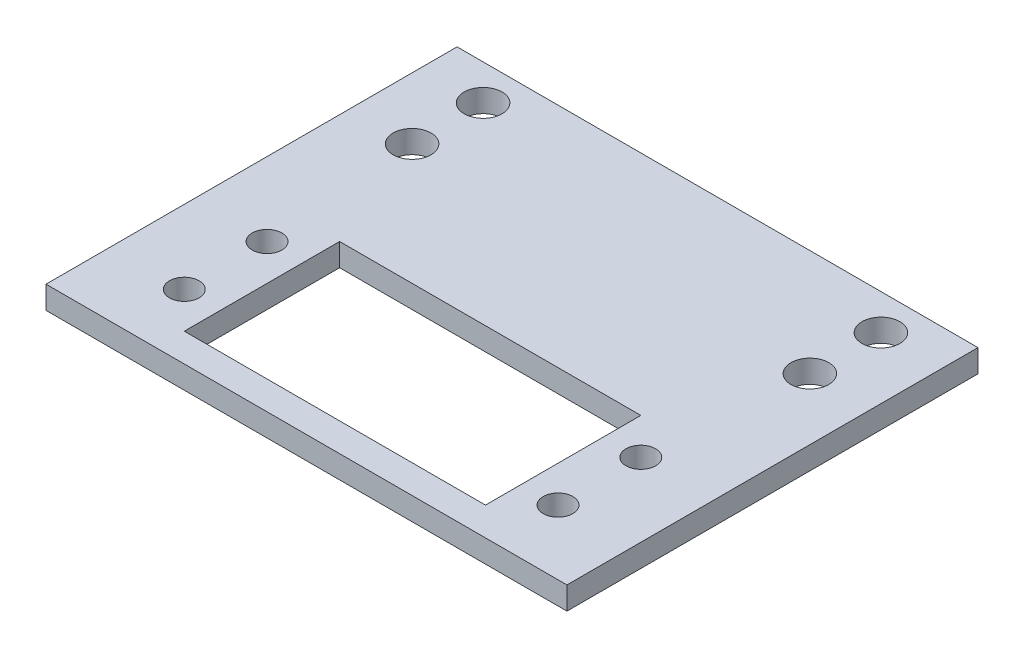
ISO-10303-21;
HEADER;
FILE_DESCRIPTION(('STEP AP214'),'2;1');
FILE_NAME('part.step','',(''),(''),'','','');
FILE_SCHEMA(('AUTOMOTIVE_DESIGN { 1 0 10303 214 1 1 1 1 }'));
ENDSEC;
DATA;
#1=APPLICATION_CONTEXT('core data for automotive mechanical design processes');
#2=APPLICATION_PROTOCOL_DEFINITION('international standard','automotive_design',2000,#1);
#3=PRODUCT_CONTEXT('',#1,'mechanical');
#4=PRODUCT('Part','Part','',(#3));
#5=PRODUCT_RELATED_PRODUCT_CATEGORY('part','',(#4));
#6=PRODUCT_DEFINITION_FORMATION('','',#4);
#7=PRODUCT_DEFINITION_CONTEXT('part definition',#1,'design');
#8=PRODUCT_DEFINITION('design','',#6,#7);
#9=PRODUCT_DEFINITION_SHAPE('','',#8);
#10=(LENGTH_UNIT() NAMED_UNIT(*) SI_UNIT(.MILLI.,.METRE.));
#11=(NAMED_UNIT(*) PLANE_ANGLE_UNIT() SI_UNIT($,.RADIAN.));
#12=(NAMED_UNIT(*) SI_UNIT($,.STERADIAN.) SOLID_ANGLE_UNIT());
#13=UNCERTAINTY_MEASURE_WITH_UNIT(LENGTH_MEASURE(1.E-05),#10,'distance_accuracy_value','');
#14=(GEOMETRIC_REPRESENTATION_CONTEXT(3) GLOBAL_UNCERTAINTY_ASSIGNED_CONTEXT((#13)) GLOBAL_UNIT_ASSIGNED_CONTEXT((#10,
#11,#12)) REPRESENTATION_CONTEXT('',''));
#15=CARTESIAN_POINT('',(0.,0.,0.));
#16=DIRECTION('',(0.,0.,1.));
#17=DIRECTION('',(1.,0.,0.));
#18=AXIS2_PLACEMENT_3D('',#15,#16,#17);
#19=CARTESIAN_POINT('',(0.,3.048,0.));
#20=DIRECTION('',(0.,1.,0.));
#21=DIRECTION('',(0.,0.,1.));
#22=AXIS2_PLACEMENT_3D('',#19,#20,#21);
#23=PLANE('',#22);
#24=CARTESIAN_POINT('',(26.67,3.048,-26.6065));
#25=DIRECTION('',(0.,1.,0.));
#26=DIRECTION('',(0.,0.,-1.));
#27=AXIS2_PLACEMENT_3D('',#24,#25,#26);
#28=CIRCLE('',#27,2.54);
#29=CARTESIAN_POINT('',(26.67,3.048,-29.1465));
#30=VERTEX_POINT('',#29);
#31=EDGE_CURVE('E264',#30,#30,#28,.T.);
#32=ORIENTED_EDGE('',*,*,#31,.F.);
#33=EDGE_LOOP('',(#32));
#34=FACE_BOUND('',#33,.T.);
#35=CARTESIAN_POINT('',(-26.67,3.048,-36.1315));
#36=DIRECTION('',(0.,1.,0.));
#37=DIRECTION('',(0.,0.,1.));
#38=AXIS2_PLACEMENT_3D('',#35,#36,#37);
#39=CIRCLE('',#38,2.54);
#40=CARTESIAN_POINT('',(-26.67,3.048,-33.5915));
#41=VERTEX_POINT('',#40);
#42=EDGE_CURVE('E276',#41,#41,#39,.T.);
#43=ORIENTED_EDGE('',*,*,#42,.F.);
#44=EDGE_LOOP('',(#43));
#45=FACE_BOUND('',#44,.T.);
#46=CARTESIAN_POINT('',(25.0571,3.048,5.54990000000001));
#47=DIRECTION('',(0.,1.,0.));
#48=DIRECTION('',(0.,0.,-1.));
#49=AXIS2_PLACEMENT_3D('',#46,#47,#48);
#50=CIRCLE('',#49,1.98755);
#51=CARTESIAN_POINT('',(25.0571,3.048,3.56235000000002));
#52=VERTEX_POINT('',#51);
#53=EDGE_CURVE('E288',#52,#52,#50,.T.);
#54=ORIENTED_EDGE('',*,*,#53,.F.);
#55=EDGE_LOOP('',(#54));
#56=FACE_BOUND('',#55,.T.);
#57=CARTESIAN_POINT('',(-25.0571,3.048,5.5499));
#58=DIRECTION('',(0.,1.,0.));
#59=DIRECTION('',(0.,0.,1.));
#60=AXIS2_PLACEMENT_3D('',#57,#58,#59);
#61=CIRCLE('',#60,1.98755);
#62=CARTESIAN_POINT('',(-25.0571,3.048,7.53745));
#63=VERTEX_POINT('',#62);
#64=EDGE_CURVE('E129',#63,#63,#61,.T.);
#65=ORIENTED_EDGE('',*,*,#64,.F.);
#66=EDGE_LOOP('',(#65));
#67=FACE_BOUND('',#66,.T.);
#68=DIRECTION('',(0.,0.,1.));
#69=VECTOR('',#68,1.);
#70=CARTESIAN_POINT('',(-34.925,3.048,-40.894));
#71=LINE('',#70,#69);
#72=CARTESIAN_POINT('',(-34.925,3.048,-40.894));
#73=VERTEX_POINT('',#72);
#74=CARTESIAN_POINT('',(-34.925,3.048,14.224));
#75=VERTEX_POINT('',#74);
#76=EDGE_CURVE('E139',#73,#75,#71,.T.);
#77=ORIENTED_EDGE('',*,*,#76,.T.);
#78=DIRECTION('',(1.,0.,0.));
#79=VECTOR('',#78,1.);
#80=CARTESIAN_POINT('',(-34.925,3.048,14.224));
#81=LINE('',#80,#79);
#82=CARTESIAN_POINT('',(34.925,3.048,14.224));
#83=VERTEX_POINT('',#82);
#84=EDGE_CURVE('E142',#75,#83,#81,.T.);
#85=ORIENTED_EDGE('',*,*,#84,.T.);
#86=DIRECTION('',(0.,0.,-1.));
#87=VECTOR('',#86,1.);
#88=CARTESIAN_POINT('',(34.925,3.048,-40.894));
#89=LINE('',#88,#87);
#90=CARTESIAN_POINT('',(34.925,3.048,-40.894));
#91=VERTEX_POINT('',#90);
#92=EDGE_CURVE('E145',#83,#91,#89,.T.);
#93=ORIENTED_EDGE('',*,*,#92,.T.);
#94=DIRECTION('',(-1.,0.,0.));
#95=VECTOR('',#94,1.);
#96=CARTESIAN_POINT('',(-34.925,3.048,-40.894));
#97=LINE('',#96,#95);
#98=EDGE_CURVE('E147',#91,#73,#97,.T.);
#99=ORIENTED_EDGE('',*,*,#98,.T.);
#100=EDGE_LOOP('',(#77,#85,#93,#99));
#101=FACE_BOUND('',#100,.T.);
#102=DIRECTION('',(-1.,0.,0.));
#103=VECTOR('',#102,1.);
#104=CARTESIAN_POINT('',(-20.193,3.048,-10.414));
#105=LINE('',#104,#103);
#106=CARTESIAN_POINT('',(20.193,3.048,-10.414));
#107=VERTEX_POINT('',#106);
#108=CARTESIAN_POINT('',(-20.193,3.048,-10.414));
#109=VERTEX_POINT('',#108);
#110=EDGE_CURVE('E108',#107,#109,#105,.T.);
#111=ORIENTED_EDGE('',*,*,#110,.F.);
#112=DIRECTION('',(0.,0.,-1.));
#113=VECTOR('',#112,1.);
#114=CARTESIAN_POINT('',(20.193,3.048,10.414));
#115=LINE('',#114,#113);
#116=CARTESIAN_POINT('',(20.193,3.048,10.414));
#117=VERTEX_POINT('',#116);
#118=EDGE_CURVE('E100',#117,#107,#115,.T.);
#119=ORIENTED_EDGE('',*,*,#118,.F.);
#120=DIRECTION('',(1.,0.,0.));
#121=VECTOR('',#120,1.);
#122=CARTESIAN_POINT('',(-20.193,3.048,10.414));
#123=LINE('',#122,#121);
#124=CARTESIAN_POINT('',(-20.193,3.048,10.414));
#125=VERTEX_POINT('',#124);
#126=EDGE_CURVE('E123',#125,#117,#123,.T.);
#127=ORIENTED_EDGE('',*,*,#126,.F.);
#128=DIRECTION('',(0.,0.,1.));
#129=VECTOR('',#128,1.);
#130=CARTESIAN_POINT('',(-20.193,3.048,10.414));
#131=LINE('',#130,#129);
#132=EDGE_CURVE('E121',#109,#125,#131,.T.);
#133=ORIENTED_EDGE('',*,*,#132,.F.);
#134=EDGE_LOOP('',(#111,#119,#127,#133));
#135=FACE_BOUND('',#134,.T.);
#136=CARTESIAN_POINT('',(-25.0571,3.048,-5.5499));
#137=DIRECTION('',(0.,1.,0.));
#138=DIRECTION('',(0.,0.,-1.));
#139=AXIS2_PLACEMENT_3D('',#136,#137,#138);
#140=CIRCLE('',#139,1.98755);
#141=CARTESIAN_POINT('',(-25.0571,3.048,-7.53745));
#142=VERTEX_POINT('',#141);
#143=EDGE_CURVE('E294',#142,#142,#140,.T.);
#144=ORIENTED_EDGE('',*,*,#143,.F.);
#145=EDGE_LOOP('',(#144));
#146=FACE_BOUND('',#145,.T.);
#147=CARTESIAN_POINT('',(25.0571,3.048,-5.54989999999999));
#148=DIRECTION('',(0.,1.,0.));
#149=DIRECTION('',(0.,0.,1.));
#150=AXIS2_PLACEMENT_3D('',#147,#148,#149);
#151=CIRCLE('',#150,1.98755);
#152=CARTESIAN_POINT('',(25.0571,3.048,-3.56235));
#153=VERTEX_POINT('',#152);
#154=EDGE_CURVE('E282',#153,#153,#151,.T.);
#155=ORIENTED_EDGE('',*,*,#154,.F.);
#156=EDGE_LOOP('',(#155));
#157=FACE_BOUND('',#156,.T.);
#158=CARTESIAN_POINT('',(-26.67,3.048,-26.6065));
#159=DIRECTION('',(0.,1.,0.));
#160=DIRECTION('',(0.,0.,1.));
#161=AXIS2_PLACEMENT_3D('',#158,#159,#160);
#162=CIRCLE('',#161,2.54);
#163=CARTESIAN_POINT('',(-26.67,3.048,-24.0665));
#164=VERTEX_POINT('',#163);
#165=EDGE_CURVE('E270',#164,#164,#162,.T.);
#166=ORIENTED_EDGE('',*,*,#165,.F.);
#167=EDGE_LOOP('',(#166));
#168=FACE_BOUND('',#167,.T.);
#169=CARTESIAN_POINT('',(26.67,3.048,-36.1315));
#170=DIRECTION('',(0.,1.,0.));
#171=DIRECTION('',(0.,0.,-1.));
#172=AXIS2_PLACEMENT_3D('',#169,#170,#171);
#173=CIRCLE('',#172,2.54);
#174=CARTESIAN_POINT('',(26.67,3.048,-38.6715));
#175=VERTEX_POINT('',#174);
#176=EDGE_CURVE('E255',#175,#175,#173,.T.);
#177=ORIENTED_EDGE('',*,*,#176,.F.);
#178=EDGE_LOOP('',(#177));
#179=FACE_BOUND('',#178,.T.);
#180=ADVANCED_FACE('F35',(#34,#45,#56,#67,#101,#135,#146,#157,#168,#179),#23,.T.);
#181=CARTESIAN_POINT('',(0.,0.,0.));
#182=DIRECTION('',(0.,1.,0.));
#183=DIRECTION('',(0.,0.,1.));
#184=AXIS2_PLACEMENT_3D('',#181,#182,#183);
#185=PLANE('',#184);
#186=CARTESIAN_POINT('',(26.67,0.,-26.6065));
#187=DIRECTION('',(0.,1.,0.));
#188=DIRECTION('',(0.,0.,-1.));
#189=AXIS2_PLACEMENT_3D('',#186,#187,#188);
#190=CIRCLE('',#189,2.54);
#191=CARTESIAN_POINT('',(26.67,0.,-29.1465));
#192=VERTEX_POINT('',#191);
#193=EDGE_CURVE('E261',#192,#192,#190,.T.);
#194=ORIENTED_EDGE('',*,*,#193,.T.);
#195=EDGE_LOOP('',(#194));
#196=FACE_BOUND('',#195,.T.);
#197=CARTESIAN_POINT('',(-26.67,0.,-36.1315));
#198=DIRECTION('',(0.,1.,0.));
#199=DIRECTION('',(0.,0.,1.));
#200=AXIS2_PLACEMENT_3D('',#197,#198,#199);
#201=CIRCLE('',#200,2.54);
#202=CARTESIAN_POINT('',(-26.67,0.,-33.5915));
#203=VERTEX_POINT('',#202);
#204=EDGE_CURVE('E273',#203,#203,#201,.T.);
#205=ORIENTED_EDGE('',*,*,#204,.T.);
#206=EDGE_LOOP('',(#205));
#207=FACE_BOUND('',#206,.T.);
#208=CARTESIAN_POINT('',(25.0571,0.,5.54990000000001));
#209=DIRECTION('',(0.,1.,0.));
#210=DIRECTION('',(0.,0.,-1.));
#211=AXIS2_PLACEMENT_3D('',#208,#209,#210);
#212=CIRCLE('',#211,1.98755);
#213=CARTESIAN_POINT('',(25.0571,0.,3.56235000000002));
#214=VERTEX_POINT('',#213);
#215=EDGE_CURVE('E285',#214,#214,#212,.T.);
#216=ORIENTED_EDGE('',*,*,#215,.T.);
#217=EDGE_LOOP('',(#216));
#218=FACE_BOUND('',#217,.T.);
#219=CARTESIAN_POINT('',(-25.0571,0.,5.5499));
#220=DIRECTION('',(0.,1.,0.));
#221=DIRECTION('',(0.,0.,1.));
#222=AXIS2_PLACEMENT_3D('',#219,#220,#221);
#223=CIRCLE('',#222,1.98755);
#224=CARTESIAN_POINT('',(-25.0571,0.,7.53745));
#225=VERTEX_POINT('',#224);
#226=EDGE_CURVE('E297',#225,#225,#223,.T.);
#227=ORIENTED_EDGE('',*,*,#226,.T.);
#228=EDGE_LOOP('',(#227));
#229=FACE_BOUND('',#228,.T.);
#230=DIRECTION('',(0.,0.,1.));
#231=VECTOR('',#230,1.);
#232=CARTESIAN_POINT('',(-34.925,0.,-40.894));
#233=LINE('',#232,#231);
#234=CARTESIAN_POINT('',(-34.925,0.,-40.894));
#235=VERTEX_POINT('',#234);
#236=CARTESIAN_POINT('',(-34.925,0.,14.224));
#237=VERTEX_POINT('',#236);
#238=EDGE_CURVE('E116',#235,#237,#233,.T.);
#239=ORIENTED_EDGE('',*,*,#238,.F.);
#240=DIRECTION('',(-1.,0.,0.));
#241=VECTOR('',#240,1.);
#242=CARTESIAN_POINT('',(-34.925,0.,-40.894));
#243=LINE('',#242,#241);
#244=CARTESIAN_POINT('',(34.925,0.,-40.894));
#245=VERTEX_POINT('',#244);
#246=EDGE_CURVE('E143',#245,#235,#243,.T.);
#247=ORIENTED_EDGE('',*,*,#246,.F.);
#248=DIRECTION('',(0.,0.,-1.));
#249=VECTOR('',#248,1.);
#250=CARTESIAN_POINT('',(34.925,0.,-40.894));
#251=LINE('',#250,#249);
#252=CARTESIAN_POINT('',(34.925,0.,14.224));
#253=VERTEX_POINT('',#252);
#254=EDGE_CURVE('E154',#253,#245,#251,.T.);
#255=ORIENTED_EDGE('',*,*,#254,.F.);
#256=DIRECTION('',(1.,0.,0.));
#257=VECTOR('',#256,1.);
#258=CARTESIAN_POINT('',(-34.925,0.,14.224));
#259=LINE('',#258,#257);
#260=EDGE_CURVE('E152',#237,#253,#259,.T.);
#261=ORIENTED_EDGE('',*,*,#260,.F.);
#262=EDGE_LOOP('',(#239,#247,#255,#261));
#263=FACE_BOUND('',#262,.T.);
#264=DIRECTION('',(0.,0.,-1.));
#265=VECTOR('',#264,1.);
#266=CARTESIAN_POINT('',(20.193,0.,10.414));
#267=LINE('',#266,#265);
#268=CARTESIAN_POINT('',(20.193,0.,10.414));
#269=VERTEX_POINT('',#268);
#270=CARTESIAN_POINT('',(20.193,0.,-10.414));
#271=VERTEX_POINT('',#270);
#272=EDGE_CURVE('E58',#269,#271,#267,.T.);
#273=ORIENTED_EDGE('',*,*,#272,.T.);
#274=DIRECTION('',(-1.,0.,0.));
#275=VECTOR('',#274,1.);
#276=CARTESIAN_POINT('',(-20.193,0.,-10.414));
#277=LINE('',#276,#275);
#278=CARTESIAN_POINT('',(-20.193,0.,-10.414));
#279=VERTEX_POINT('',#278);
#280=EDGE_CURVE('E115',#271,#279,#277,.T.);
#281=ORIENTED_EDGE('',*,*,#280,.T.);
#282=DIRECTION('',(0.,0.,1.));
#283=VECTOR('',#282,1.);
#284=CARTESIAN_POINT('',(-20.193,0.,10.414));
#285=LINE('',#284,#283);
#286=CARTESIAN_POINT('',(-20.193,0.,10.414));
#287=VERTEX_POINT('',#286);
#288=EDGE_CURVE('E131',#279,#287,#285,.T.);
#289=ORIENTED_EDGE('',*,*,#288,.T.);
#290=DIRECTION('',(1.,0.,0.));
#291=VECTOR('',#290,1.);
#292=CARTESIAN_POINT('',(-20.193,0.,10.414));
#293=LINE('',#292,#291);
#294=EDGE_CURVE('E109',#287,#269,#293,.T.);
#295=ORIENTED_EDGE('',*,*,#294,.T.);
#296=EDGE_LOOP('',(#273,#281,#289,#295));
#297=FACE_BOUND('',#296,.T.);
#298=CARTESIAN_POINT('',(-25.0571,0.,-5.5499));
#299=DIRECTION('',(0.,1.,0.));
#300=DIRECTION('',(0.,0.,-1.));
#301=AXIS2_PLACEMENT_3D('',#298,#299,#300);
#302=CIRCLE('',#301,1.98755);
#303=CARTESIAN_POINT('',(-25.0571,0.,-7.53745));
#304=VERTEX_POINT('',#303);
#305=EDGE_CURVE('E291',#304,#304,#302,.T.);
#306=ORIENTED_EDGE('',*,*,#305,.T.);
#307=EDGE_LOOP('',(#306));
#308=FACE_BOUND('',#307,.T.);
#309=CARTESIAN_POINT('',(25.0571,0.,-5.54989999999999));
#310=DIRECTION('',(0.,1.,0.));
#311=DIRECTION('',(0.,0.,1.));
#312=AXIS2_PLACEMENT_3D('',#309,#310,#311);
#313=CIRCLE('',#312,1.98755);
#314=CARTESIAN_POINT('',(25.0571,0.,-3.56235));
#315=VERTEX_POINT('',#314);
#316=EDGE_CURVE('E279',#315,#315,#313,.T.);
#317=ORIENTED_EDGE('',*,*,#316,.T.);
#318=EDGE_LOOP('',(#317));
#319=FACE_BOUND('',#318,.T.);
#320=CARTESIAN_POINT('',(-26.67,0.,-26.6065));
#321=DIRECTION('',(0.,1.,0.));
#322=DIRECTION('',(0.,0.,1.));
#323=AXIS2_PLACEMENT_3D('',#320,#321,#322);
#324=CIRCLE('',#323,2.54);
#325=CARTESIAN_POINT('',(-26.67,0.,-24.0665));
#326=VERTEX_POINT('',#325);
#327=EDGE_CURVE('E267',#326,#326,#324,.T.);
#328=ORIENTED_EDGE('',*,*,#327,.T.);
#329=EDGE_LOOP('',(#328));
#330=FACE_BOUND('',#329,.T.);
#331=CARTESIAN_POINT('',(26.67,0.,-36.1315));
#332=DIRECTION('',(0.,1.,0.));
#333=DIRECTION('',(0.,0.,-1.));
#334=AXIS2_PLACEMENT_3D('',#331,#332,#333);
#335=CIRCLE('',#334,2.54);
#336=CARTESIAN_POINT('',(26.67,0.,-38.6715));
#337=VERTEX_POINT('',#336);
#338=EDGE_CURVE('E258',#337,#337,#335,.T.);
#339=ORIENTED_EDGE('',*,*,#338,.T.);
#340=EDGE_LOOP('',(#339));
#341=FACE_BOUND('',#340,.T.);
#342=ADVANCED_FACE('F172',(#196,#207,#218,#229,#263,#297,#308,#319,#330,#341),#185,.F.);
#343=CARTESIAN_POINT('',(-34.925,3.048,-40.894));
#344=DIRECTION('',(1.,0.,0.));
#345=DIRECTION('',(0.,0.,-1.));
#346=AXIS2_PLACEMENT_3D('',#343,#344,#345);
#347=PLANE('',#346);
#348=ORIENTED_EDGE('',*,*,#238,.T.);
#349=DIRECTION('',(0.,-1.,0.));
#350=VECTOR('',#349,1.);
#351=CARTESIAN_POINT('',(-34.925,3.048,14.224));
#352=LINE('',#351,#350);
#353=EDGE_CURVE('E11',#75,#237,#352,.T.);
#354=ORIENTED_EDGE('',*,*,#353,.F.);
#355=ORIENTED_EDGE('',*,*,#76,.F.);
#356=DIRECTION('',(0.,-1.,0.));
#357=VECTOR('',#356,1.);
#358=CARTESIAN_POINT('',(-34.925,3.048,-40.894));
#359=LINE('',#358,#357);
#360=EDGE_CURVE('E149',#73,#235,#359,.T.);
#361=ORIENTED_EDGE('',*,*,#360,.T.);
#362=EDGE_LOOP('',(#348,#354,#355,#361));
#363=FACE_BOUND('',#362,.T.);
#364=ADVANCED_FACE('F37',(#363),#347,.F.);
#365=CARTESIAN_POINT('',(-34.925,3.048,14.224));
#366=DIRECTION('',(0.,0.,-1.));
#367=DIRECTION('',(-1.,0.,0.));
#368=AXIS2_PLACEMENT_3D('',#365,#366,#367);
#369=PLANE('',#368);
#370=ORIENTED_EDGE('',*,*,#260,.T.);
#371=DIRECTION('',(0.,-1.,0.));
#372=VECTOR('',#371,1.);
#373=CARTESIAN_POINT('',(34.925,3.048,14.224));
#374=LINE('',#373,#372);
#375=EDGE_CURVE('E43',#83,#253,#374,.T.);
#376=ORIENTED_EDGE('',*,*,#375,.F.);
#377=ORIENTED_EDGE('',*,*,#84,.F.);
#378=ORIENTED_EDGE('',*,*,#353,.T.);
#379=EDGE_LOOP('',(#370,#376,#377,#378));
#380=FACE_BOUND('',#379,.T.);
#381=ADVANCED_FACE('F182',(#380),#369,.F.);
#382=CARTESIAN_POINT('',(34.925,3.048,-40.894));
#383=DIRECTION('',(-1.,0.,0.));
#384=DIRECTION('',(0.,0.,1.));
#385=AXIS2_PLACEMENT_3D('',#382,#383,#384);
#386=PLANE('',#385);
#387=ORIENTED_EDGE('',*,*,#254,.T.);
#388=DIRECTION('',(0.,-1.,0.));
#389=VECTOR('',#388,1.);
#390=CARTESIAN_POINT('',(34.925,3.048,-40.894));
#391=LINE('',#390,#389);
#392=EDGE_CURVE('E159',#91,#245,#391,.T.);
#393=ORIENTED_EDGE('',*,*,#392,.F.);
#394=ORIENTED_EDGE('',*,*,#92,.F.);
#395=ORIENTED_EDGE('',*,*,#375,.T.);
#396=EDGE_LOOP('',(#387,#393,#394,#395));
#397=FACE_BOUND('',#396,.T.);
#398=ADVANCED_FACE('F166',(#397),#386,.F.);
#399=CARTESIAN_POINT('',(-34.925,3.048,-40.894));
#400=DIRECTION('',(0.,0.,1.));
#401=DIRECTION('',(1.,0.,0.));
#402=AXIS2_PLACEMENT_3D('',#399,#400,#401);
#403=PLANE('',#402);
#404=ORIENTED_EDGE('',*,*,#246,.T.);
#405=ORIENTED_EDGE('',*,*,#360,.F.);
#406=ORIENTED_EDGE('',*,*,#98,.F.);
#407=ORIENTED_EDGE('',*,*,#392,.T.);
#408=EDGE_LOOP('',(#404,#405,#406,#407));
#409=FACE_BOUND('',#408,.T.);
#410=ADVANCED_FACE('F176',(#409),#403,.F.);
#411=CARTESIAN_POINT('',(20.193,3.048,10.414));
#412=DIRECTION('',(-1.,0.,0.));
#413=DIRECTION('',(0.,0.,1.));
#414=AXIS2_PLACEMENT_3D('',#411,#412,#413);
#415=PLANE('',#414);
#416=ORIENTED_EDGE('',*,*,#272,.F.);
#417=DIRECTION('',(0.,-1.,0.));
#418=VECTOR('',#417,1.);
#419=CARTESIAN_POINT('',(20.193,3.048,10.414));
#420=LINE('',#419,#418);
#421=EDGE_CURVE('E104',#117,#269,#420,.T.);
#422=ORIENTED_EDGE('',*,*,#421,.F.);
#423=ORIENTED_EDGE('',*,*,#118,.T.);
#424=DIRECTION('',(0.,-1.,0.));
#425=VECTOR('',#424,1.);
#426=CARTESIAN_POINT('',(20.193,3.048,-10.414));
#427=LINE('',#426,#425);
#428=EDGE_CURVE('E103',#107,#271,#427,.T.);
#429=ORIENTED_EDGE('',*,*,#428,.T.);
#430=EDGE_LOOP('',(#416,#422,#423,#429));
#431=FACE_BOUND('',#430,.T.);
#432=ADVANCED_FACE('F102',(#431),#415,.T.);
#433=CARTESIAN_POINT('',(-20.193,3.048,-10.414));
#434=DIRECTION('',(0.,0.,1.));
#435=DIRECTION('',(1.,0.,0.));
#436=AXIS2_PLACEMENT_3D('',#433,#434,#435);
#437=PLANE('',#436);
#438=ORIENTED_EDGE('',*,*,#280,.F.);
#439=ORIENTED_EDGE('',*,*,#428,.F.);
#440=ORIENTED_EDGE('',*,*,#110,.T.);
#441=DIRECTION('',(0.,-1.,0.));
#442=VECTOR('',#441,1.);
#443=CARTESIAN_POINT('',(-20.193,3.048,-10.414));
#444=LINE('',#443,#442);
#445=EDGE_CURVE('E117',#109,#279,#444,.T.);
#446=ORIENTED_EDGE('',*,*,#445,.T.);
#447=EDGE_LOOP('',(#438,#439,#440,#446));
#448=FACE_BOUND('',#447,.T.);
#449=ADVANCED_FACE('F112',(#448),#437,.T.);
#450=CARTESIAN_POINT('',(-20.193,3.048,10.414));
#451=DIRECTION('',(1.,0.,0.));
#452=DIRECTION('',(0.,0.,-1.));
#453=AXIS2_PLACEMENT_3D('',#450,#451,#452);
#454=PLANE('',#453);
#455=ORIENTED_EDGE('',*,*,#288,.F.);
#456=ORIENTED_EDGE('',*,*,#445,.F.);
#457=ORIENTED_EDGE('',*,*,#132,.T.);
#458=DIRECTION('',(0.,-1.,0.));
#459=VECTOR('',#458,1.);
#460=CARTESIAN_POINT('',(-20.193,3.048,10.414));
#461=LINE('',#460,#459);
#462=EDGE_CURVE('E50',#125,#287,#461,.T.);
#463=ORIENTED_EDGE('',*,*,#462,.T.);
#464=EDGE_LOOP('',(#455,#456,#457,#463));
#465=FACE_BOUND('',#464,.T.);
#466=ADVANCED_FACE('F209',(#465),#454,.T.);
#467=CARTESIAN_POINT('',(-20.193,3.048,10.414));
#468=DIRECTION('',(0.,0.,-1.));
#469=DIRECTION('',(-1.,0.,0.));
#470=AXIS2_PLACEMENT_3D('',#467,#468,#469);
#471=PLANE('',#470);
#472=ORIENTED_EDGE('',*,*,#294,.F.);
#473=ORIENTED_EDGE('',*,*,#462,.F.);
#474=ORIENTED_EDGE('',*,*,#126,.T.);
#475=ORIENTED_EDGE('',*,*,#421,.T.);
#476=EDGE_LOOP('',(#472,#473,#474,#475));
#477=FACE_BOUND('',#476,.T.);
#478=ADVANCED_FACE('F213',(#477),#471,.T.);
#479=CARTESIAN_POINT('',(-25.0571,3.048,5.5499));
#480=DIRECTION('',(0.,-1.,0.));
#481=DIRECTION('',(0.,0.,-1.));
#482=AXIS2_PLACEMENT_3D('',#479,#480,#481);
#483=CYLINDRICAL_SURFACE('',#482,1.98755);
#484=ORIENTED_EDGE('',*,*,#64,.T.);
#485=EDGE_LOOP('',(#484));
#486=FACE_BOUND('',#485,.T.);
#487=ORIENTED_EDGE('',*,*,#226,.F.);
#488=EDGE_LOOP('',(#487));
#489=FACE_BOUND('',#488,.T.);
#490=ADVANCED_FACE('F219',(#486,#489),#483,.F.);
#491=CARTESIAN_POINT('',(-25.0571,3.048,-5.5499));
#492=DIRECTION('',(0.,-1.,0.));
#493=DIRECTION('',(0.,0.,-1.));
#494=AXIS2_PLACEMENT_3D('',#491,#492,#493);
#495=CYLINDRICAL_SURFACE('',#494,1.98755);
#496=ORIENTED_EDGE('',*,*,#143,.T.);
#497=EDGE_LOOP('',(#496));
#498=FACE_BOUND('',#497,.T.);
#499=ORIENTED_EDGE('',*,*,#305,.F.);
#500=EDGE_LOOP('',(#499));
#501=FACE_BOUND('',#500,.T.);
#502=ADVANCED_FACE('F222',(#498,#501),#495,.F.);
#503=CARTESIAN_POINT('',(25.0571,3.048,5.54990000000001));
#504=DIRECTION('',(0.,-1.,0.));
#505=DIRECTION('',(0.,0.,-1.));
#506=AXIS2_PLACEMENT_3D('',#503,#504,#505);
#507=CYLINDRICAL_SURFACE('',#506,1.98755);
#508=ORIENTED_EDGE('',*,*,#53,.T.);
#509=EDGE_LOOP('',(#508));
#510=FACE_BOUND('',#509,.T.);
#511=ORIENTED_EDGE('',*,*,#215,.F.);
#512=EDGE_LOOP('',(#511));
#513=FACE_BOUND('',#512,.T.);
#514=ADVANCED_FACE('F226',(#510,#513),#507,.F.);
#515=CARTESIAN_POINT('',(25.0571,3.048,-5.54989999999999));
#516=DIRECTION('',(0.,-1.,0.));
#517=DIRECTION('',(0.,0.,-1.));
#518=AXIS2_PLACEMENT_3D('',#515,#516,#517);
#519=CYLINDRICAL_SURFACE('',#518,1.98755);
#520=ORIENTED_EDGE('',*,*,#154,.T.);
#521=EDGE_LOOP('',(#520));
#522=FACE_BOUND('',#521,.T.);
#523=ORIENTED_EDGE('',*,*,#316,.F.);
#524=EDGE_LOOP('',(#523));
#525=FACE_BOUND('',#524,.T.);
#526=ADVANCED_FACE('F230',(#522,#525),#519,.F.);
#527=CARTESIAN_POINT('',(-26.67,3.048,-36.1315));
#528=DIRECTION('',(0.,-1.,0.));
#529=DIRECTION('',(0.,0.,-1.));
#530=AXIS2_PLACEMENT_3D('',#527,#528,#529);
#531=CYLINDRICAL_SURFACE('',#530,2.54);
#532=ORIENTED_EDGE('',*,*,#42,.T.);
#533=EDGE_LOOP('',(#532));
#534=FACE_BOUND('',#533,.T.);
#535=ORIENTED_EDGE('',*,*,#204,.F.);
#536=EDGE_LOOP('',(#535));
#537=FACE_BOUND('',#536,.T.);
#538=ADVANCED_FACE('F234',(#534,#537),#531,.F.);
#539=CARTESIAN_POINT('',(-26.67,3.048,-26.6065));
#540=DIRECTION('',(0.,-1.,0.));
#541=DIRECTION('',(0.,0.,-1.));
#542=AXIS2_PLACEMENT_3D('',#539,#540,#541);
#543=CYLINDRICAL_SURFACE('',#542,2.54);
#544=ORIENTED_EDGE('',*,*,#165,.T.);
#545=EDGE_LOOP('',(#544));
#546=FACE_BOUND('',#545,.T.);
#547=ORIENTED_EDGE('',*,*,#327,.F.);
#548=EDGE_LOOP('',(#547));
#549=FACE_BOUND('',#548,.T.);
#550=ADVANCED_FACE('F238',(#546,#549),#543,.F.);
#551=CARTESIAN_POINT('',(26.67,3.048,-26.6065));
#552=DIRECTION('',(0.,-1.,0.));
#553=DIRECTION('',(0.,0.,-1.));
#554=AXIS2_PLACEMENT_3D('',#551,#552,#553);
#555=CYLINDRICAL_SURFACE('',#554,2.54);
#556=ORIENTED_EDGE('',*,*,#31,.T.);
#557=EDGE_LOOP('',(#556));
#558=FACE_BOUND('',#557,.T.);
#559=ORIENTED_EDGE('',*,*,#193,.F.);
#560=EDGE_LOOP('',(#559));
#561=FACE_BOUND('',#560,.T.);
#562=ADVANCED_FACE('F242',(#558,#561),#555,.F.);
#563=CARTESIAN_POINT('',(26.67,3.048,-36.1315));
#564=DIRECTION('',(0.,-1.,0.));
#565=DIRECTION('',(0.,0.,-1.));
#566=AXIS2_PLACEMENT_3D('',#563,#564,#565);
#567=CYLINDRICAL_SURFACE('',#566,2.54);
#568=ORIENTED_EDGE('',*,*,#176,.T.);
#569=EDGE_LOOP('',(#568));
#570=FACE_BOUND('',#569,.T.);
#571=ORIENTED_EDGE('',*,*,#338,.F.);
#572=EDGE_LOOP('',(#571));
#573=FACE_BOUND('',#572,.T.);
#574=ADVANCED_FACE('F246',(#570,#573),#567,.F.);
#575=CLOSED_SHELL('',(#180,#342,#364,#381,#398,#410,#432,#449,#466,#478,#490,#502,#514,#526,
#538,#550,#562,#574));
#576=MANIFOLD_SOLID_BREP('B2',#575);
#577=ADVANCED_BREP_SHAPE_REPRESENTATION('',(#18,#576),#14);
#578=SHAPE_DEFINITION_REPRESENTATION(#9,#577);
ENDSEC;
END-ISO-10303-21;
